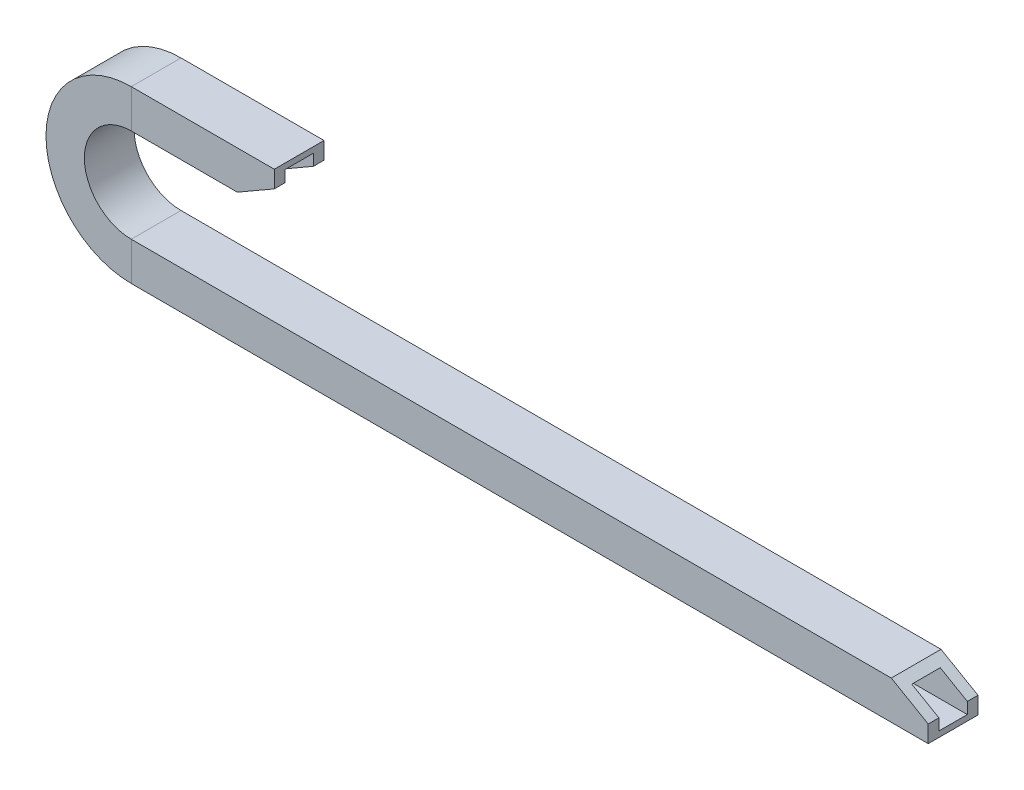
ISO-10303-21;
HEADER;
FILE_DESCRIPTION(('STEP AP214'),'2;1');
FILE_NAME('part.step','',(''),(''),'','','');
FILE_SCHEMA(('AUTOMOTIVE_DESIGN { 1 0 10303 214 1 1 1 1 }'));
ENDSEC;
DATA;
#1=APPLICATION_CONTEXT('core data for automotive mechanical design processes');
#2=APPLICATION_PROTOCOL_DEFINITION('international standard','automotive_design',2000,#1);
#3=PRODUCT_CONTEXT('',#1,'mechanical');
#4=PRODUCT('Part','Part','',(#3));
#5=PRODUCT_RELATED_PRODUCT_CATEGORY('part','',(#4));
#6=PRODUCT_DEFINITION_FORMATION('','',#4);
#7=PRODUCT_DEFINITION_CONTEXT('part definition',#1,'design');
#8=PRODUCT_DEFINITION('design','',#6,#7);
#9=PRODUCT_DEFINITION_SHAPE('','',#8);
#10=(LENGTH_UNIT() NAMED_UNIT(*) SI_UNIT(.MILLI.,.METRE.));
#11=(NAMED_UNIT(*) PLANE_ANGLE_UNIT() SI_UNIT($,.RADIAN.));
#12=(NAMED_UNIT(*) SI_UNIT($,.STERADIAN.) SOLID_ANGLE_UNIT());
#13=UNCERTAINTY_MEASURE_WITH_UNIT(LENGTH_MEASURE(1.E-05),#10,'distance_accuracy_value','');
#14=(GEOMETRIC_REPRESENTATION_CONTEXT(3) GLOBAL_UNCERTAINTY_ASSIGNED_CONTEXT((#13)) GLOBAL_UNIT_ASSIGNED_CONTEXT((#10,
#11,#12)) REPRESENTATION_CONTEXT('',''));
#15=CARTESIAN_POINT('',(0.,0.,0.));
#16=DIRECTION('',(0.,0.,1.));
#17=DIRECTION('',(1.,0.,0.));
#18=AXIS2_PLACEMENT_3D('',#15,#16,#17);
#19=CARTESIAN_POINT('',(-4.20000000035438,60.9799999998486,-34.5618189982806));
#20=DIRECTION('',(0.499722453489577,-0.866185586048601,0.));
#21=DIRECTION('',(0.866185586048601,0.499722453489577,0.));
#22=AXIS2_PLACEMENT_3D('',#19,#20,#21);
#23=PLANE('',#22);
#24=DIRECTION('',(0.,0.,1.));
#25=VECTOR('',#24,1.);
#26=CARTESIAN_POINT('',(-4.20000000035438,60.9799999998486,-34.5618189982806));
#27=LINE('',#26,#25);
#28=CARTESIAN_POINT('',(-4.20000000035438,60.9799999998486,-8.75000000000001));
#29=VERTEX_POINT('',#28);
#30=CARTESIAN_POINT('',(-4.20000000035438,60.9799999998486,-5.));
#31=VERTEX_POINT('',#30);
#32=EDGE_CURVE('E394',#29,#31,#27,.T.);
#33=ORIENTED_EDGE('',*,*,#32,.T.);
#34=DIRECTION('',(-0.866185586048601,-0.499722453489577,0.));
#35=VECTOR('',#34,1.);
#36=CARTESIAN_POINT('',(-4.20000000035438,60.9799999998486,-5.));
#37=LINE('',#36,#35);
#38=CARTESIAN_POINT('',(-13.7333333336876,55.4799999998487,-5.));
#39=VERTEX_POINT('',#38);
#40=EDGE_CURVE('E531',#31,#39,#37,.T.);
#41=ORIENTED_EDGE('',*,*,#40,.T.);
#42=DIRECTION('',(0.,0.,1.));
#43=VECTOR('',#42,1.);
#44=CARTESIAN_POINT('',(-13.7333333336876,55.4799999998487,-34.5618189982806));
#45=LINE('',#44,#43);
#46=CARTESIAN_POINT('',(-13.7333333336877,55.4799999998487,5.));
#47=VERTEX_POINT('',#46);
#48=EDGE_CURVE('E13',#39,#47,#45,.T.);
#49=ORIENTED_EDGE('',*,*,#48,.T.);
#50=DIRECTION('',(0.866185586048601,0.499722453489577,0.));
#51=VECTOR('',#50,1.);
#52=CARTESIAN_POINT('',(-4.20000000035438,60.9799999998486,5.));
#53=LINE('',#52,#51);
#54=CARTESIAN_POINT('',(-4.20000000035438,60.9799999998486,5.));
#55=VERTEX_POINT('',#54);
#56=EDGE_CURVE('E535',#47,#55,#53,.T.);
#57=ORIENTED_EDGE('',*,*,#56,.T.);
#58=CARTESIAN_POINT('',(-4.20000000035438,60.9799999998486,8.75000000000001));
#59=VERTEX_POINT('',#58);
#60=EDGE_CURVE('E400',#55,#59,#27,.T.);
#61=ORIENTED_EDGE('',*,*,#60,.T.);
#62=DIRECTION('',(0.866185586048601,0.499722453489577,0.));
#63=VECTOR('',#62,1.);
#64=CARTESIAN_POINT('',(-4.20000000035438,60.9799999998486,8.75000000000001));
#65=LINE('',#64,#63);
#66=CARTESIAN_POINT('',(-17.2000000003544,53.4799999998485,8.75000000000001));
#67=VERTEX_POINT('',#66);
#68=EDGE_CURVE('E418',#67,#59,#65,.T.);
#69=ORIENTED_EDGE('',*,*,#68,.F.);
#70=DIRECTION('',(0.,0.,1.));
#71=VECTOR('',#70,1.);
#72=CARTESIAN_POINT('',(-17.2000000003544,53.4799999998485,-34.5618189982806));
#73=LINE('',#72,#71);
#74=CARTESIAN_POINT('',(-17.2000000003544,53.4799999998485,-8.75000000000001));
#75=VERTEX_POINT('',#74);
#76=EDGE_CURVE('E404',#75,#67,#73,.T.);
#77=ORIENTED_EDGE('',*,*,#76,.F.);
#78=DIRECTION('',(0.866185586048601,0.499722453489577,0.));
#79=VECTOR('',#78,1.);
#80=CARTESIAN_POINT('',(-4.20000000035438,60.9799999998486,-8.75000000000001));
#81=LINE('',#80,#79);
#82=EDGE_CURVE('E420',#75,#29,#81,.T.);
#83=ORIENTED_EDGE('',*,*,#82,.T.);
#84=EDGE_LOOP('',(#33,#41,#49,#57,#61,#69,#77,#83));
#85=FACE_BOUND('',#84,.T.);
#86=ADVANCED_FACE('F48',(#85),#23,.T.);
#87=CARTESIAN_POINT('',(-4.20000000035438,66.9799999998486,-34.5618189982806));
#88=DIRECTION('',(1.,0.,0.));
#89=DIRECTION('',(0.,0.,-1.));
#90=AXIS2_PLACEMENT_3D('',#87,#88,#89);
#91=PLANE('',#90);
#92=DIRECTION('',(0.,0.,1.));
#93=VECTOR('',#92,1.);
#94=CARTESIAN_POINT('',(-4.20000000035438,64.9799999998486,5.));
#95=LINE('',#94,#93);
#96=CARTESIAN_POINT('',(-4.20000000035438,64.9799999998486,-5.));
#97=VERTEX_POINT('',#96);
#98=CARTESIAN_POINT('',(-4.20000000035438,64.9799999998486,5.));
#99=VERTEX_POINT('',#98);
#100=EDGE_CURVE('E246',#97,#99,#95,.T.);
#101=ORIENTED_EDGE('',*,*,#100,.F.);
#102=DIRECTION('',(0.,-1.,0.));
#103=VECTOR('',#102,1.);
#104=CARTESIAN_POINT('',(-4.20000000035438,66.9799999998486,-5.));
#105=LINE('',#104,#103);
#106=EDGE_CURVE('E58',#97,#31,#105,.T.);
#107=ORIENTED_EDGE('',*,*,#106,.T.);
#108=ORIENTED_EDGE('',*,*,#32,.F.);
#109=DIRECTION('',(0.,1.,0.));
#110=VECTOR('',#109,1.);
#111=CARTESIAN_POINT('',(-4.20000000035438,66.9799999998486,-8.75000000000001));
#112=LINE('',#111,#110);
#113=CARTESIAN_POINT('',(-4.20000000035438,66.9799999998486,-8.75000000000001));
#114=VERTEX_POINT('',#113);
#115=EDGE_CURVE('E399',#29,#114,#112,.T.);
#116=ORIENTED_EDGE('',*,*,#115,.T.);
#117=DIRECTION('',(0.,0.,1.));
#118=VECTOR('',#117,1.);
#119=CARTESIAN_POINT('',(-4.20000000035438,66.9799999998486,-34.5618189982806));
#120=LINE('',#119,#118);
#121=CARTESIAN_POINT('',(-4.20000000035438,66.9799999998486,8.75000000000001));
#122=VERTEX_POINT('',#121);
#123=EDGE_CURVE('E401',#114,#122,#120,.T.);
#124=ORIENTED_EDGE('',*,*,#123,.T.);
#125=DIRECTION('',(0.,1.,0.));
#126=VECTOR('',#125,1.);
#127=CARTESIAN_POINT('',(-4.20000000035438,66.9799999998486,8.75000000000001));
#128=LINE('',#127,#126);
#129=EDGE_CURVE('E827',#59,#122,#128,.T.);
#130=ORIENTED_EDGE('',*,*,#129,.F.);
#131=ORIENTED_EDGE('',*,*,#60,.F.);
#132=DIRECTION('',(0.,-1.,0.));
#133=VECTOR('',#132,1.);
#134=CARTESIAN_POINT('',(-4.20000000035438,64.9799999998486,5.));
#135=LINE('',#134,#133);
#136=EDGE_CURVE('E379',#99,#55,#135,.T.);
#137=ORIENTED_EDGE('',*,*,#136,.F.);
#138=EDGE_LOOP('',(#101,#107,#108,#116,#124,#130,#131,#137));
#139=FACE_BOUND('',#138,.T.);
#140=ADVANCED_FACE('F824',(#139),#91,.T.);
#141=CARTESIAN_POINT('',(225.81795525974,7.00000000020795,-34.5618189982806));
#142=DIRECTION('',(1.,0.,0.));
#143=DIRECTION('',(0.,0.,-1.));
#144=AXIS2_PLACEMENT_3D('',#141,#142,#143);
#145=PLANE('',#144);
#146=DIRECTION('',(0.,0.,1.));
#147=VECTOR('',#146,1.);
#148=CARTESIAN_POINT('',(225.81795525974,13.000000000208,-34.5618189982806));
#149=LINE('',#148,#147);
#150=CARTESIAN_POINT('',(225.81795525974,13.000000000208,-8.75000000000001));
#151=VERTEX_POINT('',#150);
#152=CARTESIAN_POINT('',(225.81795525974,13.000000000208,-5.));
#153=VERTEX_POINT('',#152);
#154=EDGE_CURVE('E239',#151,#153,#149,.T.);
#155=ORIENTED_EDGE('',*,*,#154,.T.);
#156=DIRECTION('',(0.,1.,0.));
#157=VECTOR('',#156,1.);
#158=CARTESIAN_POINT('',(225.81795525974,9.0000000002079,-5.));
#159=LINE('',#158,#157);
#160=CARTESIAN_POINT('',(225.81795525974,9.0000000002079,-5.));
#161=VERTEX_POINT('',#160);
#162=EDGE_CURVE('E215',#161,#153,#159,.T.);
#163=ORIENTED_EDGE('',*,*,#162,.F.);
#164=DIRECTION('',(0.,0.,-1.));
#165=VECTOR('',#164,1.);
#166=CARTESIAN_POINT('',(225.81795525974,9.0000000002079,5.));
#167=LINE('',#166,#165);
#168=CARTESIAN_POINT('',(225.81795525974,9.0000000002079,5.));
#169=VERTEX_POINT('',#168);
#170=EDGE_CURVE('E227',#169,#161,#167,.T.);
#171=ORIENTED_EDGE('',*,*,#170,.F.);
#172=DIRECTION('',(0.,-1.,0.));
#173=VECTOR('',#172,1.);
#174=CARTESIAN_POINT('',(225.81795525974,9.0000000002079,5.));
#175=LINE('',#174,#173);
#176=CARTESIAN_POINT('',(225.81795525974,13.000000000208,5.));
#177=VERTEX_POINT('',#176);
#178=EDGE_CURVE('E241',#177,#169,#175,.T.);
#179=ORIENTED_EDGE('',*,*,#178,.F.);
#180=CARTESIAN_POINT('',(225.81795525974,13.000000000208,8.75000000000001));
#181=VERTEX_POINT('',#180);
#182=EDGE_CURVE('E272',#177,#181,#149,.T.);
#183=ORIENTED_EDGE('',*,*,#182,.T.);
#184=DIRECTION('',(0.,1.,0.));
#185=VECTOR('',#184,1.);
#186=CARTESIAN_POINT('',(225.81795525974,7.00000000020795,8.75000000000001));
#187=LINE('',#186,#185);
#188=CARTESIAN_POINT('',(225.81795525974,7.00000000020795,8.75000000000001));
#189=VERTEX_POINT('',#188);
#190=EDGE_CURVE('E495',#189,#181,#187,.T.);
#191=ORIENTED_EDGE('',*,*,#190,.F.);
#192=DIRECTION('',(0.,0.,1.));
#193=VECTOR('',#192,1.);
#194=CARTESIAN_POINT('',(225.81795525974,7.00000000020795,-34.5618189982806));
#195=LINE('',#194,#193);
#196=CARTESIAN_POINT('',(225.81795525974,7.00000000020795,-8.75000000000001));
#197=VERTEX_POINT('',#196);
#198=EDGE_CURVE('E276',#197,#189,#195,.T.);
#199=ORIENTED_EDGE('',*,*,#198,.F.);
#200=DIRECTION('',(0.,1.,0.));
#201=VECTOR('',#200,1.);
#202=CARTESIAN_POINT('',(225.81795525974,7.00000000020795,-8.75000000000001));
#203=LINE('',#202,#201);
#204=EDGE_CURVE('E497',#197,#151,#203,.T.);
#205=ORIENTED_EDGE('',*,*,#204,.T.);
#206=EDGE_LOOP('',(#155,#163,#171,#179,#183,#191,#199,#205));
#207=FACE_BOUND('',#206,.T.);
#208=ADVANCED_FACE('F236',(#207),#145,.T.);
#209=CARTESIAN_POINT('',(225.81795525974,13.000000000208,-34.5618189982806));
#210=DIRECTION('',(0.499722453489576,0.866185586048601,0.));
#211=DIRECTION('',(-0.866185586048601,0.499722453489576,0.));
#212=AXIS2_PLACEMENT_3D('',#209,#210,#211);
#213=PLANE('',#212);
#214=DIRECTION('',(0.,0.,-1.));
#215=VECTOR('',#214,1.);
#216=CARTESIAN_POINT('',(216.284621926407,18.5000000002079,-34.5618189982806));
#217=LINE('',#216,#215);
#218=CARTESIAN_POINT('',(216.284621926407,18.5000000002079,5.));
#219=VERTEX_POINT('',#218);
#220=CARTESIAN_POINT('',(216.284621926407,18.5000000002079,-5.));
#221=VERTEX_POINT('',#220);
#222=EDGE_CURVE('E300',#219,#221,#217,.T.);
#223=ORIENTED_EDGE('',*,*,#222,.T.);
#224=DIRECTION('',(0.866185586048601,-0.499722453489576,0.));
#225=VECTOR('',#224,1.);
#226=CARTESIAN_POINT('',(225.81795525974,13.000000000208,-5.));
#227=LINE('',#226,#225);
#228=EDGE_CURVE('E481',#221,#153,#227,.T.);
#229=ORIENTED_EDGE('',*,*,#228,.T.);
#230=ORIENTED_EDGE('',*,*,#154,.F.);
#231=DIRECTION('',(-0.866185586048601,0.499722453489576,0.));
#232=VECTOR('',#231,1.);
#233=CARTESIAN_POINT('',(225.81795525974,13.000000000208,-8.75000000000001));
#234=LINE('',#233,#232);
#235=CARTESIAN_POINT('',(212.81795525974,20.5000000002079,-8.75000000000001));
#236=VERTEX_POINT('',#235);
#237=EDGE_CURVE('E271',#151,#236,#234,.T.);
#238=ORIENTED_EDGE('',*,*,#237,.T.);
#239=DIRECTION('',(0.,0.,1.));
#240=VECTOR('',#239,1.);
#241=CARTESIAN_POINT('',(212.81795525974,20.5000000002079,-34.5618189982806));
#242=LINE('',#241,#240);
#243=CARTESIAN_POINT('',(212.81795525974,20.5000000002079,8.75000000000001));
#244=VERTEX_POINT('',#243);
#245=EDGE_CURVE('E273',#236,#244,#242,.T.);
#246=ORIENTED_EDGE('',*,*,#245,.T.);
#247=DIRECTION('',(-0.866185586048601,0.499722453489576,0.));
#248=VECTOR('',#247,1.);
#249=CARTESIAN_POINT('',(225.81795525974,13.000000000208,8.75000000000001));
#250=LINE('',#249,#248);
#251=EDGE_CURVE('E537',#181,#244,#250,.T.);
#252=ORIENTED_EDGE('',*,*,#251,.F.);
#253=ORIENTED_EDGE('',*,*,#182,.F.);
#254=DIRECTION('',(-0.866185586048601,0.499722453489576,0.));
#255=VECTOR('',#254,1.);
#256=CARTESIAN_POINT('',(225.81795525974,13.000000000208,5.));
#257=LINE('',#256,#255);
#258=EDGE_CURVE('E294',#177,#219,#257,.T.);
#259=ORIENTED_EDGE('',*,*,#258,.T.);
#260=EDGE_LOOP('',(#223,#229,#230,#238,#246,#252,#253,#259));
#261=FACE_BOUND('',#260,.T.);
#262=ADVANCED_FACE('F892',(#261),#213,.T.);
#263=CARTESIAN_POINT('',(203.81795525974,20.5000000002079,8.75000000000001));
#264=DIRECTION('',(0.,1.,0.));
#265=DIRECTION('',(-1.,0.,0.));
#266=AXIS2_PLACEMENT_3D('',#263,#264,#265);
#267=PLANE('',#266);
#268=DIRECTION('',(-1.,0.,0.));
#269=VECTOR('',#268,1.);
#270=CARTESIAN_POINT('',(203.81795525974,20.5000000002079,-8.75000000000001));
#271=LINE('',#270,#269);
#272=CARTESIAN_POINT('',(-54.503416211368,20.5000000002079,-8.75000000000001));
#273=VERTEX_POINT('',#272);
#274=EDGE_CURVE('E470',#236,#273,#271,.T.);
#275=ORIENTED_EDGE('',*,*,#274,.T.);
#276=DIRECTION('',(0.,0.,-1.));
#277=VECTOR('',#276,1.);
#278=CARTESIAN_POINT('',(-54.503416211368,20.5000000002079,8.75000000000001));
#279=LINE('',#278,#277);
#280=CARTESIAN_POINT('',(-54.503416211368,20.5000000002079,8.75000000000001));
#281=VERTEX_POINT('',#280);
#282=EDGE_CURVE('E466',#281,#273,#279,.T.);
#283=ORIENTED_EDGE('',*,*,#282,.F.);
#284=DIRECTION('',(-1.,0.,0.));
#285=VECTOR('',#284,1.);
#286=CARTESIAN_POINT('',(203.81795525974,20.5000000002079,8.75000000000001));
#287=LINE('',#286,#285);
#288=EDGE_CURVE('E457',#244,#281,#287,.T.);
#289=ORIENTED_EDGE('',*,*,#288,.F.);
#290=ORIENTED_EDGE('',*,*,#245,.F.);
#291=EDGE_LOOP('',(#275,#283,#289,#290));
#292=FACE_BOUND('',#291,.T.);
#293=ADVANCED_FACE('F888',(#292),#267,.T.);
#294=CARTESIAN_POINT('',(203.81795525974,20.5000000002079,-8.75000000000001));
#295=DIRECTION('',(0.,0.,-1.));
#296=DIRECTION('',(-1.,0.,0.));
#297=AXIS2_PLACEMENT_3D('',#294,#295,#296);
#298=PLANE('',#297);
#299=DIRECTION('',(-1.,0.,0.));
#300=VECTOR('',#299,1.);
#301=CARTESIAN_POINT('',(203.81795525974,7.00000000020795,-8.75000000000001));
#302=LINE('',#301,#300);
#303=CARTESIAN_POINT('',(-54.503416211368,7.00000000020784,-8.75000000000001));
#304=VERTEX_POINT('',#303);
#305=EDGE_CURVE('E508',#197,#304,#302,.T.);
#306=ORIENTED_EDGE('',*,*,#305,.T.);
#307=DIRECTION('',(0.,-1.,0.));
#308=VECTOR('',#307,1.);
#309=CARTESIAN_POINT('',(-54.503416211368,20.5000000002079,-8.75000000000001));
#310=LINE('',#309,#308);
#311=EDGE_CURVE('E512',#273,#304,#310,.T.);
#312=ORIENTED_EDGE('',*,*,#311,.F.);
#313=ORIENTED_EDGE('',*,*,#274,.F.);
#314=ORIENTED_EDGE('',*,*,#237,.F.);
#315=ORIENTED_EDGE('',*,*,#204,.F.);
#316=EDGE_LOOP('',(#306,#312,#313,#314,#315));
#317=FACE_BOUND('',#316,.T.);
#318=ADVANCED_FACE('F891',(#317),#298,.T.);
#319=CARTESIAN_POINT('',(203.81795525974,7.00000000020795,8.75000000000001));
#320=DIRECTION('',(0.,-1.,0.));
#321=DIRECTION('',(1.,0.,0.));
#322=AXIS2_PLACEMENT_3D('',#319,#320,#321);
#323=PLANE('',#322);
#324=DIRECTION('',(-1.,0.,0.));
#325=VECTOR('',#324,1.);
#326=CARTESIAN_POINT('',(203.81795525974,7.00000000020795,8.75000000000001));
#327=LINE('',#326,#325);
#328=CARTESIAN_POINT('',(-54.503416211368,7.00000000020784,8.75000000000001));
#329=VERTEX_POINT('',#328);
#330=EDGE_CURVE('E320',#189,#329,#327,.T.);
#331=ORIENTED_EDGE('',*,*,#330,.T.);
#332=DIRECTION('',(0.,0.,1.));
#333=VECTOR('',#332,1.);
#334=CARTESIAN_POINT('',(-54.503416211368,7.00000000020784,8.75000000000001));
#335=LINE('',#334,#333);
#336=EDGE_CURVE('E350',#304,#329,#335,.T.);
#337=ORIENTED_EDGE('',*,*,#336,.F.);
#338=ORIENTED_EDGE('',*,*,#305,.F.);
#339=ORIENTED_EDGE('',*,*,#198,.T.);
#340=EDGE_LOOP('',(#331,#337,#338,#339));
#341=FACE_BOUND('',#340,.T.);
#342=ADVANCED_FACE('F842',(#341),#323,.T.);
#343=CARTESIAN_POINT('',(203.81795525974,20.5000000002079,8.75000000000001));
#344=DIRECTION('',(0.,0.,1.));
#345=DIRECTION('',(0.,-1.,0.));
#346=AXIS2_PLACEMENT_3D('',#343,#344,#345);
#347=PLANE('',#346);
#348=DIRECTION('',(0.,1.,0.));
#349=VECTOR('',#348,1.);
#350=CARTESIAN_POINT('',(-54.503416211368,20.5000000002079,8.75000000000001));
#351=LINE('',#350,#349);
#352=EDGE_CURVE('E314',#329,#281,#351,.T.);
#353=ORIENTED_EDGE('',*,*,#352,.F.);
#354=ORIENTED_EDGE('',*,*,#330,.F.);
#355=ORIENTED_EDGE('',*,*,#190,.T.);
#356=ORIENTED_EDGE('',*,*,#251,.T.);
#357=ORIENTED_EDGE('',*,*,#288,.T.);
#358=EDGE_LOOP('',(#353,#354,#355,#356,#357));
#359=FACE_BOUND('',#358,.T.);
#360=ADVANCED_FACE('F898',(#359),#347,.T.);
#361=CARTESIAN_POINT('',(-54.503416211368,36.9900000000283,0.));
#362=DIRECTION('',(0.,0.,-1.));
#363=DIRECTION('',(-1.,0.,0.));
#364=AXIS2_PLACEMENT_3D('',#361,#362,#363);
#365=CYLINDRICAL_SURFACE('',#364,16.4899999998203);
#366=CARTESIAN_POINT('',(-54.503416211368,36.9900000000283,-8.75000000000001));
#367=DIRECTION('',(0.,0.,-1.));
#368=DIRECTION('',(0.,-1.,0.));
#369=AXIS2_PLACEMENT_3D('',#366,#367,#368);
#370=CIRCLE('',#369,16.4899999998203);
#371=CARTESIAN_POINT('',(-54.503416211368,53.4799999998484,-8.75000000000001));
#372=VERTEX_POINT('',#371);
#373=EDGE_CURVE('E456',#273,#372,#370,.T.);
#374=ORIENTED_EDGE('',*,*,#373,.T.);
#375=DIRECTION('',(0.,0.,-1.));
#376=VECTOR('',#375,1.);
#377=CARTESIAN_POINT('',(-54.503416211368,53.4799999998487,8.75000000000001));
#378=LINE('',#377,#376);
#379=CARTESIAN_POINT('',(-54.503416211368,53.4799999998484,8.75000000000001));
#380=VERTEX_POINT('',#379);
#381=EDGE_CURVE('E451',#380,#372,#378,.T.);
#382=ORIENTED_EDGE('',*,*,#381,.F.);
#383=CARTESIAN_POINT('',(-54.503416211368,36.9900000000283,8.75000000000001));
#384=DIRECTION('',(0.,0.,-1.));
#385=DIRECTION('',(0.,-1.,0.));
#386=AXIS2_PLACEMENT_3D('',#383,#384,#385);
#387=CIRCLE('',#386,16.4899999998203);
#388=EDGE_CURVE('E319',#281,#380,#387,.T.);
#389=ORIENTED_EDGE('',*,*,#388,.F.);
#390=ORIENTED_EDGE('',*,*,#282,.T.);
#391=EDGE_LOOP('',(#374,#382,#389,#390));
#392=FACE_BOUND('',#391,.T.);
#393=ADVANCED_FACE('F894',(#392),#365,.F.);
#394=CARTESIAN_POINT('',(-54.503416211368,20.500000000208,-8.75000000000001));
#395=DIRECTION('',(0.,0.,-1.));
#396=DIRECTION('',(-1.,0.,0.));
#397=AXIS2_PLACEMENT_3D('',#394,#395,#396);
#398=PLANE('',#397);
#399=CARTESIAN_POINT('',(-54.503416211368,36.9900000000283,-8.75000000000001));
#400=DIRECTION('',(0.,0.,-1.));
#401=DIRECTION('',(0.,-1.,0.));
#402=AXIS2_PLACEMENT_3D('',#399,#400,#401);
#403=CIRCLE('',#402,29.9899999998203);
#404=CARTESIAN_POINT('',(-54.503416211368,66.9799999998485,-8.75000000000001));
#405=VERTEX_POINT('',#404);
#406=EDGE_CURVE('E347',#304,#405,#403,.T.);
#407=ORIENTED_EDGE('',*,*,#406,.T.);
#408=DIRECTION('',(0.,1.,0.));
#409=VECTOR('',#408,1.);
#410=CARTESIAN_POINT('',(-54.503416211368,53.4799999998487,-8.75000000000001));
#411=LINE('',#410,#409);
#412=EDGE_CURVE('E514',#372,#405,#411,.T.);
#413=ORIENTED_EDGE('',*,*,#412,.F.);
#414=ORIENTED_EDGE('',*,*,#373,.F.);
#415=ORIENTED_EDGE('',*,*,#311,.T.);
#416=EDGE_LOOP('',(#407,#413,#414,#415));
#417=FACE_BOUND('',#416,.T.);
#418=ADVANCED_FACE('F897',(#417),#398,.T.);
#419=CARTESIAN_POINT('',(-54.503416211368,36.9900000000283,0.));
#420=DIRECTION('',(0.,0.,-1.));
#421=DIRECTION('',(-1.,0.,0.));
#422=AXIS2_PLACEMENT_3D('',#419,#420,#421);
#423=CYLINDRICAL_SURFACE('',#422,29.9899999998203);
#424=CARTESIAN_POINT('',(-54.503416211368,36.9900000000283,8.75000000000001));
#425=DIRECTION('',(0.,0.,-1.));
#426=DIRECTION('',(0.,-1.,0.));
#427=AXIS2_PLACEMENT_3D('',#424,#425,#426);
#428=CIRCLE('',#427,29.9899999998203);
#429=CARTESIAN_POINT('',(-54.503416211368,66.9799999998485,8.75000000000001));
#430=VERTEX_POINT('',#429);
#431=EDGE_CURVE('E326',#329,#430,#428,.T.);
#432=ORIENTED_EDGE('',*,*,#431,.T.);
#433=DIRECTION('',(0.,0.,1.));
#434=VECTOR('',#433,1.);
#435=CARTESIAN_POINT('',(-54.503416211368,66.9799999998486,8.75000000000001));
#436=LINE('',#435,#434);
#437=EDGE_CURVE('E359',#405,#430,#436,.T.);
#438=ORIENTED_EDGE('',*,*,#437,.F.);
#439=ORIENTED_EDGE('',*,*,#406,.F.);
#440=ORIENTED_EDGE('',*,*,#336,.T.);
#441=EDGE_LOOP('',(#432,#438,#439,#440));
#442=FACE_BOUND('',#441,.T.);
#443=ADVANCED_FACE('F911',(#442),#423,.T.);
#444=CARTESIAN_POINT('',(-54.503416211368,20.500000000208,8.75000000000001));
#445=DIRECTION('',(0.,0.,1.));
#446=DIRECTION('',(1.,0.,0.));
#447=AXIS2_PLACEMENT_3D('',#444,#445,#446);
#448=PLANE('',#447);
#449=DIRECTION('',(0.,-1.,0.));
#450=VECTOR('',#449,1.);
#451=CARTESIAN_POINT('',(-54.503416211368,53.4799999998487,8.75000000000001));
#452=LINE('',#451,#450);
#453=EDGE_CURVE('E302',#430,#380,#452,.T.);
#454=ORIENTED_EDGE('',*,*,#453,.F.);
#455=ORIENTED_EDGE('',*,*,#431,.F.);
#456=ORIENTED_EDGE('',*,*,#352,.T.);
#457=ORIENTED_EDGE('',*,*,#388,.T.);
#458=EDGE_LOOP('',(#454,#455,#456,#457));
#459=FACE_BOUND('',#458,.T.);
#460=ADVANCED_FACE('F904',(#459),#448,.T.);
#461=CARTESIAN_POINT('',(-54.503416211368,53.4799999998485,8.75000000000001));
#462=DIRECTION('',(0.,-1.,0.));
#463=DIRECTION('',(0.,0.,-1.));
#464=AXIS2_PLACEMENT_3D('',#461,#462,#463);
#465=PLANE('',#464);
#466=DIRECTION('',(1.,0.,0.));
#467=VECTOR('',#466,1.);
#468=CARTESIAN_POINT('',(-54.503416211368,53.4799999998485,-8.75000000000001));
#469=LINE('',#468,#467);
#470=EDGE_CURVE('E346',#372,#75,#469,.T.);
#471=ORIENTED_EDGE('',*,*,#470,.T.);
#472=ORIENTED_EDGE('',*,*,#76,.T.);
#473=DIRECTION('',(1.,0.,0.));
#474=VECTOR('',#473,1.);
#475=CARTESIAN_POINT('',(-54.503416211368,53.4799999998485,8.75000000000001));
#476=LINE('',#475,#474);
#477=EDGE_CURVE('E439',#380,#67,#476,.T.);
#478=ORIENTED_EDGE('',*,*,#477,.F.);
#479=ORIENTED_EDGE('',*,*,#381,.T.);
#480=EDGE_LOOP('',(#471,#472,#478,#479));
#481=FACE_BOUND('',#480,.T.);
#482=ADVANCED_FACE('F900',(#481),#465,.T.);
#483=CARTESIAN_POINT('',(-54.503416211368,53.4799999998485,-8.75000000000001));
#484=DIRECTION('',(0.,0.,-1.));
#485=DIRECTION('',(-1.,0.,0.));
#486=AXIS2_PLACEMENT_3D('',#483,#484,#485);
#487=PLANE('',#486);
#488=DIRECTION('',(1.,0.,0.));
#489=VECTOR('',#488,1.);
#490=CARTESIAN_POINT('',(-54.503416211368,66.9799999998486,-8.75000000000001));
#491=LINE('',#490,#489);
#492=EDGE_CURVE('E325',#405,#114,#491,.T.);
#493=ORIENTED_EDGE('',*,*,#492,.T.);
#494=ORIENTED_EDGE('',*,*,#115,.F.);
#495=ORIENTED_EDGE('',*,*,#82,.F.);
#496=ORIENTED_EDGE('',*,*,#470,.F.);
#497=ORIENTED_EDGE('',*,*,#412,.T.);
#498=EDGE_LOOP('',(#493,#494,#495,#496,#497));
#499=FACE_BOUND('',#498,.T.);
#500=ADVANCED_FACE('F903',(#499),#487,.T.);
#501=CARTESIAN_POINT('',(-54.503416211368,66.9799999998486,8.75000000000001));
#502=DIRECTION('',(0.,1.,0.));
#503=DIRECTION('',(0.,0.,1.));
#504=AXIS2_PLACEMENT_3D('',#501,#502,#503);
#505=PLANE('',#504);
#506=DIRECTION('',(1.,0.,0.));
#507=VECTOR('',#506,1.);
#508=CARTESIAN_POINT('',(-54.503416211368,66.9799999998486,8.75000000000001));
#509=LINE('',#508,#507);
#510=EDGE_CURVE('E301',#430,#122,#509,.T.);
#511=ORIENTED_EDGE('',*,*,#510,.T.);
#512=ORIENTED_EDGE('',*,*,#123,.F.);
#513=ORIENTED_EDGE('',*,*,#492,.F.);
#514=ORIENTED_EDGE('',*,*,#437,.T.);
#515=EDGE_LOOP('',(#511,#512,#513,#514));
#516=FACE_BOUND('',#515,.T.);
#517=ADVANCED_FACE('F915',(#516),#505,.T.);
#518=CARTESIAN_POINT('',(-54.503416211368,53.4799999998485,8.75000000000001));
#519=DIRECTION('',(0.,0.,1.));
#520=DIRECTION('',(0.,-1.,0.));
#521=AXIS2_PLACEMENT_3D('',#518,#519,#520);
#522=PLANE('',#521);
#523=ORIENTED_EDGE('',*,*,#477,.T.);
#524=ORIENTED_EDGE('',*,*,#68,.T.);
#525=ORIENTED_EDGE('',*,*,#129,.T.);
#526=ORIENTED_EDGE('',*,*,#510,.F.);
#527=ORIENTED_EDGE('',*,*,#453,.T.);
#528=EDGE_LOOP('',(#523,#524,#525,#526,#527));
#529=FACE_BOUND('',#528,.T.);
#530=ADVANCED_FACE('F50',(#529),#522,.T.);
#531=CARTESIAN_POINT('',(-26.2000000003544,64.9799999998486,-5.));
#532=DIRECTION('',(0.,0.,1.));
#533=DIRECTION('',(0.,-1.,0.));
#534=AXIS2_PLACEMENT_3D('',#531,#532,#533);
#535=PLANE('',#534);
#536=ORIENTED_EDGE('',*,*,#106,.F.);
#537=DIRECTION('',(1.,0.,0.));
#538=VECTOR('',#537,1.);
#539=CARTESIAN_POINT('',(-26.2000000003544,64.9799999998486,-5.));
#540=LINE('',#539,#538);
#541=CARTESIAN_POINT('',(-26.2000000003544,64.9799999998486,-5.));
#542=VERTEX_POINT('',#541);
#543=EDGE_CURVE('E65',#542,#97,#540,.T.);
#544=ORIENTED_EDGE('',*,*,#543,.F.);
#545=DIRECTION('',(0.,-1.,0.));
#546=VECTOR('',#545,1.);
#547=CARTESIAN_POINT('',(-26.2000000003544,64.9799999998486,-5.));
#548=LINE('',#547,#546);
#549=CARTESIAN_POINT('',(-26.2000000003544,55.4799999998487,-5.));
#550=VERTEX_POINT('',#549);
#551=EDGE_CURVE('E667',#542,#550,#548,.T.);
#552=ORIENTED_EDGE('',*,*,#551,.T.);
#553=DIRECTION('',(1.,0.,0.));
#554=VECTOR('',#553,1.);
#555=CARTESIAN_POINT('',(-26.2000000003544,55.4799999998487,-5.));
#556=LINE('',#555,#554);
#557=EDGE_CURVE('E570',#550,#39,#556,.T.);
#558=ORIENTED_EDGE('',*,*,#557,.T.);
#559=ORIENTED_EDGE('',*,*,#40,.F.);
#560=EDGE_LOOP('',(#536,#544,#552,#558,#559));
#561=FACE_BOUND('',#560,.T.);
#562=ADVANCED_FACE('F859',(#561),#535,.T.);
#563=CARTESIAN_POINT('',(-26.2000000003544,55.4799999998487,5.));
#564=DIRECTION('',(0.,1.,0.));
#565=DIRECTION('',(-1.,0.,0.));
#566=AXIS2_PLACEMENT_3D('',#563,#564,#565);
#567=PLANE('',#566);
#568=ORIENTED_EDGE('',*,*,#557,.F.);
#569=DIRECTION('',(0.,0.,1.));
#570=VECTOR('',#569,1.);
#571=CARTESIAN_POINT('',(-26.2000000003544,55.4799999998487,5.));
#572=LINE('',#571,#570);
#573=CARTESIAN_POINT('',(-26.2000000003544,55.4799999998487,5.));
#574=VERTEX_POINT('',#573);
#575=EDGE_CURVE('E546',#550,#574,#572,.T.);
#576=ORIENTED_EDGE('',*,*,#575,.T.);
#577=DIRECTION('',(1.,0.,0.));
#578=VECTOR('',#577,1.);
#579=CARTESIAN_POINT('',(-26.2000000003544,55.4799999998487,5.));
#580=LINE('',#579,#578);
#581=EDGE_CURVE('E566',#574,#47,#580,.T.);
#582=ORIENTED_EDGE('',*,*,#581,.T.);
#583=ORIENTED_EDGE('',*,*,#48,.F.);
#584=EDGE_LOOP('',(#568,#576,#582,#583));
#585=FACE_BOUND('',#584,.T.);
#586=ADVANCED_FACE('F856',(#585),#567,.T.);
#587=CARTESIAN_POINT('',(-26.2000000003544,64.9799999998486,5.));
#588=DIRECTION('',(0.,0.,-1.));
#589=DIRECTION('',(-1.,0.,0.));
#590=AXIS2_PLACEMENT_3D('',#587,#588,#589);
#591=PLANE('',#590);
#592=ORIENTED_EDGE('',*,*,#581,.F.);
#593=DIRECTION('',(0.,1.,0.));
#594=VECTOR('',#593,1.);
#595=CARTESIAN_POINT('',(-26.2000000003544,64.9799999998486,5.));
#596=LINE('',#595,#594);
#597=CARTESIAN_POINT('',(-26.2000000003544,64.9799999998486,5.));
#598=VERTEX_POINT('',#597);
#599=EDGE_CURVE('E705',#574,#598,#596,.T.);
#600=ORIENTED_EDGE('',*,*,#599,.T.);
#601=DIRECTION('',(1.,0.,0.));
#602=VECTOR('',#601,1.);
#603=CARTESIAN_POINT('',(-26.2000000003544,64.9799999998486,5.));
#604=LINE('',#603,#602);
#605=EDGE_CURVE('E223',#598,#99,#604,.T.);
#606=ORIENTED_EDGE('',*,*,#605,.T.);
#607=ORIENTED_EDGE('',*,*,#136,.T.);
#608=ORIENTED_EDGE('',*,*,#56,.F.);
#609=EDGE_LOOP('',(#592,#600,#606,#607,#608));
#610=FACE_BOUND('',#609,.T.);
#611=ADVANCED_FACE('F955',(#610),#591,.T.);
#612=CARTESIAN_POINT('',(-26.2000000003544,64.9799999998486,5.));
#613=DIRECTION('',(0.,-1.,0.));
#614=DIRECTION('',(1.,0.,0.));
#615=AXIS2_PLACEMENT_3D('',#612,#613,#614);
#616=PLANE('',#615);
#617=ORIENTED_EDGE('',*,*,#100,.T.);
#618=ORIENTED_EDGE('',*,*,#605,.F.);
#619=DIRECTION('',(0.,0.,-1.));
#620=VECTOR('',#619,1.);
#621=CARTESIAN_POINT('',(-26.2000000003544,64.9799999998486,5.));
#622=LINE('',#621,#620);
#623=EDGE_CURVE('E714',#598,#542,#622,.T.);
#624=ORIENTED_EDGE('',*,*,#623,.T.);
#625=ORIENTED_EDGE('',*,*,#543,.T.);
#626=EDGE_LOOP('',(#617,#618,#624,#625));
#627=FACE_BOUND('',#626,.T.);
#628=ADVANCED_FACE('F865',(#627),#616,.T.);
#629=CARTESIAN_POINT('',(226.81795525974,9.0000000002079,-5.));
#630=DIRECTION('',(0.,0.,1.));
#631=DIRECTION('',(0.,-1.,0.));
#632=AXIS2_PLACEMENT_3D('',#629,#630,#631);
#633=PLANE('',#632);
#634=DIRECTION('',(-1.,0.,0.));
#635=VECTOR('',#634,1.);
#636=CARTESIAN_POINT('',(226.81795525974,18.5000000002079,-5.));
#637=LINE('',#636,#635);
#638=CARTESIAN_POINT('',(203.81795525974,18.5000000002079,-5.));
#639=VERTEX_POINT('',#638);
#640=EDGE_CURVE('E630',#221,#639,#637,.T.);
#641=ORIENTED_EDGE('',*,*,#640,.T.);
#642=DIRECTION('',(0.,1.,0.));
#643=VECTOR('',#642,1.);
#644=CARTESIAN_POINT('',(203.81795525974,9.00000000020784,-5.));
#645=LINE('',#644,#643);
#646=CARTESIAN_POINT('',(203.81795525974,9.0000000002079,-5.));
#647=VERTEX_POINT('',#646);
#648=EDGE_CURVE('E218',#647,#639,#645,.T.);
#649=ORIENTED_EDGE('',*,*,#648,.F.);
#650=DIRECTION('',(-1.,0.,0.));
#651=VECTOR('',#650,1.);
#652=CARTESIAN_POINT('',(226.81795525974,9.0000000002079,-5.));
#653=LINE('',#652,#651);
#654=EDGE_CURVE('E211',#161,#647,#653,.T.);
#655=ORIENTED_EDGE('',*,*,#654,.F.);
#656=ORIENTED_EDGE('',*,*,#162,.T.);
#657=ORIENTED_EDGE('',*,*,#228,.F.);
#658=EDGE_LOOP('',(#641,#649,#655,#656,#657));
#659=FACE_BOUND('',#658,.T.);
#660=ADVANCED_FACE('F213',(#659),#633,.T.);
#661=CARTESIAN_POINT('',(226.81795525974,18.5000000002079,5.));
#662=DIRECTION('',(0.,-1.,0.));
#663=DIRECTION('',(0.,0.,-1.));
#664=AXIS2_PLACEMENT_3D('',#661,#662,#663);
#665=PLANE('',#664);
#666=DIRECTION('',(-1.,0.,0.));
#667=VECTOR('',#666,1.);
#668=CARTESIAN_POINT('',(226.81795525974,18.5000000002079,5.));
#669=LINE('',#668,#667);
#670=CARTESIAN_POINT('',(203.81795525974,18.5000000002079,5.));
#671=VERTEX_POINT('',#670);
#672=EDGE_CURVE('E73',#219,#671,#669,.T.);
#673=ORIENTED_EDGE('',*,*,#672,.T.);
#674=DIRECTION('',(0.,0.,1.));
#675=VECTOR('',#674,1.);
#676=CARTESIAN_POINT('',(203.81795525974,18.5000000002079,5.));
#677=LINE('',#676,#675);
#678=EDGE_CURVE('E642',#639,#671,#677,.T.);
#679=ORIENTED_EDGE('',*,*,#678,.F.);
#680=ORIENTED_EDGE('',*,*,#640,.F.);
#681=ORIENTED_EDGE('',*,*,#222,.F.);
#682=EDGE_LOOP('',(#673,#679,#680,#681));
#683=FACE_BOUND('',#682,.T.);
#684=ADVANCED_FACE('F1050',(#683),#665,.T.);
#685=CARTESIAN_POINT('',(226.81795525974,9.0000000002079,5.));
#686=DIRECTION('',(0.,0.,-1.));
#687=DIRECTION('',(-1.,0.,0.));
#688=AXIS2_PLACEMENT_3D('',#685,#686,#687);
#689=PLANE('',#688);
#690=ORIENTED_EDGE('',*,*,#178,.T.);
#691=DIRECTION('',(-1.,0.,0.));
#692=VECTOR('',#691,1.);
#693=CARTESIAN_POINT('',(226.81795525974,9.0000000002079,5.));
#694=LINE('',#693,#692);
#695=CARTESIAN_POINT('',(203.81795525974,9.0000000002079,5.));
#696=VERTEX_POINT('',#695);
#697=EDGE_CURVE('E229',#169,#696,#694,.T.);
#698=ORIENTED_EDGE('',*,*,#697,.T.);
#699=DIRECTION('',(0.,-1.,0.));
#700=VECTOR('',#699,1.);
#701=CARTESIAN_POINT('',(203.81795525974,9.00000000020784,5.));
#702=LINE('',#701,#700);
#703=EDGE_CURVE('E641',#671,#696,#702,.T.);
#704=ORIENTED_EDGE('',*,*,#703,.F.);
#705=ORIENTED_EDGE('',*,*,#672,.F.);
#706=ORIENTED_EDGE('',*,*,#258,.F.);
#707=EDGE_LOOP('',(#690,#698,#704,#705,#706));
#708=FACE_BOUND('',#707,.T.);
#709=ADVANCED_FACE('F790',(#708),#689,.T.);
#710=CARTESIAN_POINT('',(226.81795525974,9.0000000002079,5.));
#711=DIRECTION('',(0.,1.,0.));
#712=DIRECTION('',(0.,0.,1.));
#713=AXIS2_PLACEMENT_3D('',#710,#711,#712);
#714=PLANE('',#713);
#715=ORIENTED_EDGE('',*,*,#170,.T.);
#716=ORIENTED_EDGE('',*,*,#654,.T.);
#717=DIRECTION('',(0.,0.,-1.));
#718=VECTOR('',#717,1.);
#719=CARTESIAN_POINT('',(203.81795525974,9.00000000020784,5.));
#720=LINE('',#719,#718);
#721=EDGE_CURVE('E609',#696,#647,#720,.T.);
#722=ORIENTED_EDGE('',*,*,#721,.F.);
#723=ORIENTED_EDGE('',*,*,#697,.F.);
#724=EDGE_LOOP('',(#715,#716,#722,#723));
#725=FACE_BOUND('',#724,.T.);
#726=ADVANCED_FACE('F228',(#725),#714,.T.);
#727=CARTESIAN_POINT('',(203.81795525974,9.00000000020779,-5.));
#728=DIRECTION('',(0.,0.,1.));
#729=DIRECTION('',(0.,-1.,0.));
#730=AXIS2_PLACEMENT_3D('',#727,#728,#729);
#731=PLANE('',#730);
#732=DIRECTION('',(-1.,0.,0.));
#733=VECTOR('',#732,1.);
#734=CARTESIAN_POINT('',(203.81795525974,18.5000000002078,-5.));
#735=LINE('',#734,#733);
#736=CARTESIAN_POINT('',(-54.503416211368,18.5000000002077,-5.));
#737=VERTEX_POINT('',#736);
#738=EDGE_CURVE('E767',#639,#737,#735,.T.);
#739=ORIENTED_EDGE('',*,*,#738,.T.);
#740=DIRECTION('',(0.,1.,0.));
#741=VECTOR('',#740,1.);
#742=CARTESIAN_POINT('',(-54.503416211368,9.00000000020773,-5.));
#743=LINE('',#742,#741);
#744=CARTESIAN_POINT('',(-54.503416211368,9.00000000020773,-5.));
#745=VERTEX_POINT('',#744);
#746=EDGE_CURVE('E763',#745,#737,#743,.T.);
#747=ORIENTED_EDGE('',*,*,#746,.F.);
#748=DIRECTION('',(-1.,0.,0.));
#749=VECTOR('',#748,1.);
#750=CARTESIAN_POINT('',(203.81795525974,9.00000000020779,-5.));
#751=LINE('',#750,#749);
#752=EDGE_CURVE('E614',#647,#745,#751,.T.);
#753=ORIENTED_EDGE('',*,*,#752,.F.);
#754=ORIENTED_EDGE('',*,*,#648,.T.);
#755=EDGE_LOOP('',(#739,#747,#753,#754));
#756=FACE_BOUND('',#755,.T.);
#757=ADVANCED_FACE('F803',(#756),#731,.T.);
#758=CARTESIAN_POINT('',(203.81795525974,18.5000000002078,5.));
#759=DIRECTION('',(0.,-1.,0.));
#760=DIRECTION('',(1.,0.,0.));
#761=AXIS2_PLACEMENT_3D('',#758,#759,#760);
#762=PLANE('',#761);
#763=DIRECTION('',(-1.,0.,0.));
#764=VECTOR('',#763,1.);
#765=CARTESIAN_POINT('',(203.81795525974,18.5000000002078,5.));
#766=LINE('',#765,#764);
#767=CARTESIAN_POINT('',(-54.503416211368,18.5000000002077,5.));
#768=VERTEX_POINT('',#767);
#769=EDGE_CURVE('E749',#671,#768,#766,.T.);
#770=ORIENTED_EDGE('',*,*,#769,.T.);
#771=DIRECTION('',(0.,0.,1.));
#772=VECTOR('',#771,1.);
#773=CARTESIAN_POINT('',(-54.503416211368,18.5000000002077,5.));
#774=LINE('',#773,#772);
#775=EDGE_CURVE('E754',#737,#768,#774,.T.);
#776=ORIENTED_EDGE('',*,*,#775,.F.);
#777=ORIENTED_EDGE('',*,*,#738,.F.);
#778=ORIENTED_EDGE('',*,*,#678,.T.);
#779=EDGE_LOOP('',(#770,#776,#777,#778));
#780=FACE_BOUND('',#779,.T.);
#781=ADVANCED_FACE('F782',(#780),#762,.T.);
#782=CARTESIAN_POINT('',(203.81795525974,9.00000000020779,5.));
#783=DIRECTION('',(0.,0.,-1.));
#784=DIRECTION('',(-1.,0.,0.));
#785=AXIS2_PLACEMENT_3D('',#782,#783,#784);
#786=PLANE('',#785);
#787=DIRECTION('',(-1.,0.,0.));
#788=VECTOR('',#787,1.);
#789=CARTESIAN_POINT('',(203.81795525974,9.00000000020779,5.));
#790=LINE('',#789,#788);
#791=CARTESIAN_POINT('',(-54.503416211368,9.00000000020773,5.));
#792=VERTEX_POINT('',#791);
#793=EDGE_CURVE('E587',#696,#792,#790,.T.);
#794=ORIENTED_EDGE('',*,*,#793,.T.);
#795=DIRECTION('',(0.,-1.,0.));
#796=VECTOR('',#795,1.);
#797=CARTESIAN_POINT('',(-54.503416211368,9.00000000020773,5.));
#798=LINE('',#797,#796);
#799=EDGE_CURVE('E595',#768,#792,#798,.T.);
#800=ORIENTED_EDGE('',*,*,#799,.F.);
#801=ORIENTED_EDGE('',*,*,#769,.F.);
#802=ORIENTED_EDGE('',*,*,#703,.T.);
#803=EDGE_LOOP('',(#794,#800,#801,#802));
#804=FACE_BOUND('',#803,.T.);
#805=ADVANCED_FACE('F788',(#804),#786,.T.);
#806=CARTESIAN_POINT('',(203.81795525974,9.00000000020779,5.));
#807=DIRECTION('',(0.,1.,0.));
#808=DIRECTION('',(-1.,0.,0.));
#809=AXIS2_PLACEMENT_3D('',#806,#807,#808);
#810=PLANE('',#809);
#811=DIRECTION('',(0.,0.,-1.));
#812=VECTOR('',#811,1.);
#813=CARTESIAN_POINT('',(-54.503416211368,9.00000000020773,5.));
#814=LINE('',#813,#812);
#815=EDGE_CURVE('E594',#792,#745,#814,.T.);
#816=ORIENTED_EDGE('',*,*,#815,.F.);
#817=ORIENTED_EDGE('',*,*,#793,.F.);
#818=ORIENTED_EDGE('',*,*,#721,.T.);
#819=ORIENTED_EDGE('',*,*,#752,.T.);
#820=EDGE_LOOP('',(#816,#817,#818,#819));
#821=FACE_BOUND('',#820,.T.);
#822=ADVANCED_FACE('F794',(#821),#810,.T.);
#823=CARTESIAN_POINT('',(-54.503416211368,9.00000000020784,-5.));
#824=DIRECTION('',(0.,0.,1.));
#825=DIRECTION('',(1.,0.,0.));
#826=AXIS2_PLACEMENT_3D('',#823,#824,#825);
#827=PLANE('',#826);
#828=CARTESIAN_POINT('',(-54.503416211368,36.9900000000283,-5.));
#829=DIRECTION('',(0.,0.,-1.));
#830=DIRECTION('',(0.,-1.,0.));
#831=AXIS2_PLACEMENT_3D('',#828,#829,#830);
#832=CIRCLE('',#831,18.4899999998204);
#833=CARTESIAN_POINT('',(-54.503416211368,55.4799999998485,-5.));
#834=VERTEX_POINT('',#833);
#835=EDGE_CURVE('E664',#737,#834,#832,.T.);
#836=ORIENTED_EDGE('',*,*,#835,.T.);
#837=DIRECTION('',(0.,-1.,0.));
#838=VECTOR('',#837,1.);
#839=CARTESIAN_POINT('',(-54.503416211368,64.9799999998486,-5.));
#840=LINE('',#839,#838);
#841=CARTESIAN_POINT('',(-54.503416211368,64.9799999998486,-5.));
#842=VERTEX_POINT('',#841);
#843=EDGE_CURVE('E663',#842,#834,#840,.T.);
#844=ORIENTED_EDGE('',*,*,#843,.F.);
#845=CARTESIAN_POINT('',(-54.503416211368,36.9900000000283,-5.));
#846=DIRECTION('',(0.,0.,-1.));
#847=DIRECTION('',(0.,-1.,0.));
#848=AXIS2_PLACEMENT_3D('',#845,#846,#847);
#849=CIRCLE('',#848,27.9899999998204);
#850=EDGE_CURVE('E593',#745,#842,#849,.T.);
#851=ORIENTED_EDGE('',*,*,#850,.F.);
#852=ORIENTED_EDGE('',*,*,#746,.T.);
#853=EDGE_LOOP('',(#836,#844,#851,#852));
#854=FACE_BOUND('',#853,.T.);
#855=ADVANCED_FACE('F1099',(#854),#827,.T.);
#856=CARTESIAN_POINT('',(-54.503416211368,36.9900000000283,0.));
#857=DIRECTION('',(0.,0.,-1.));
#858=DIRECTION('',(-1.,0.,0.));
#859=AXIS2_PLACEMENT_3D('',#856,#857,#858);
#860=CYLINDRICAL_SURFACE('',#859,18.4899999998204);
#861=CARTESIAN_POINT('',(-54.503416211368,36.9900000000283,5.));
#862=DIRECTION('',(0.,0.,-1.));
#863=DIRECTION('',(0.,-1.,0.));
#864=AXIS2_PLACEMENT_3D('',#861,#862,#863);
#865=CIRCLE('',#864,18.4899999998204);
#866=CARTESIAN_POINT('',(-54.503416211368,55.4799999998485,5.));
#867=VERTEX_POINT('',#866);
#868=EDGE_CURVE('E554',#768,#867,#865,.T.);
#869=ORIENTED_EDGE('',*,*,#868,.T.);
#870=DIRECTION('',(0.,0.,1.));
#871=VECTOR('',#870,1.);
#872=CARTESIAN_POINT('',(-54.503416211368,55.4799999998487,5.));
#873=LINE('',#872,#871);
#874=EDGE_CURVE('E735',#834,#867,#873,.T.);
#875=ORIENTED_EDGE('',*,*,#874,.F.);
#876=ORIENTED_EDGE('',*,*,#835,.F.);
#877=ORIENTED_EDGE('',*,*,#775,.T.);
#878=EDGE_LOOP('',(#869,#875,#876,#877));
#879=FACE_BOUND('',#878,.T.);
#880=ADVANCED_FACE('F780',(#879),#860,.T.);
#881=CARTESIAN_POINT('',(-54.503416211368,9.00000000020784,5.));
#882=DIRECTION('',(0.,0.,-1.));
#883=DIRECTION('',(-1.,0.,0.));
#884=AXIS2_PLACEMENT_3D('',#881,#882,#883);
#885=PLANE('',#884);
#886=CARTESIAN_POINT('',(-54.503416211368,36.9900000000283,5.));
#887=DIRECTION('',(0.,0.,-1.));
#888=DIRECTION('',(0.,-1.,0.));
#889=AXIS2_PLACEMENT_3D('',#886,#887,#888);
#890=CIRCLE('',#889,27.9899999998204);
#891=CARTESIAN_POINT('',(-54.503416211368,64.9799999998486,5.));
#892=VERTEX_POINT('',#891);
#893=EDGE_CURVE('E691',#792,#892,#890,.T.);
#894=ORIENTED_EDGE('',*,*,#893,.T.);
#895=DIRECTION('',(0.,1.,0.));
#896=VECTOR('',#895,1.);
#897=CARTESIAN_POINT('',(-54.503416211368,64.9799999998486,5.));
#898=LINE('',#897,#896);
#899=EDGE_CURVE('E597',#867,#892,#898,.T.);
#900=ORIENTED_EDGE('',*,*,#899,.F.);
#901=ORIENTED_EDGE('',*,*,#868,.F.);
#902=ORIENTED_EDGE('',*,*,#799,.T.);
#903=EDGE_LOOP('',(#894,#900,#901,#902));
#904=FACE_BOUND('',#903,.T.);
#905=ADVANCED_FACE('F798',(#904),#885,.T.);
#906=CARTESIAN_POINT('',(-54.503416211368,36.9900000000283,0.));
#907=DIRECTION('',(0.,0.,-1.));
#908=DIRECTION('',(-1.,0.,0.));
#909=AXIS2_PLACEMENT_3D('',#906,#907,#908);
#910=CYLINDRICAL_SURFACE('',#909,27.9899999998204);
#911=DIRECTION('',(0.,0.,-1.));
#912=VECTOR('',#911,1.);
#913=CARTESIAN_POINT('',(-54.503416211368,64.9799999998486,5.));
#914=LINE('',#913,#912);
#915=EDGE_CURVE('E704',#892,#842,#914,.T.);
#916=ORIENTED_EDGE('',*,*,#915,.F.);
#917=ORIENTED_EDGE('',*,*,#893,.F.);
#918=ORIENTED_EDGE('',*,*,#815,.T.);
#919=ORIENTED_EDGE('',*,*,#850,.T.);
#920=EDGE_LOOP('',(#916,#917,#918,#919));
#921=FACE_BOUND('',#920,.T.);
#922=ADVANCED_FACE('F802',(#921),#910,.F.);
#923=CARTESIAN_POINT('',(-54.503416211368,64.9799999998486,-5.));
#924=DIRECTION('',(0.,0.,1.));
#925=DIRECTION('',(0.,-1.,0.));
#926=AXIS2_PLACEMENT_3D('',#923,#924,#925);
#927=PLANE('',#926);
#928=DIRECTION('',(1.,0.,0.));
#929=VECTOR('',#928,1.);
#930=CARTESIAN_POINT('',(-54.503416211368,55.4799999998487,-5.));
#931=LINE('',#930,#929);
#932=EDGE_CURVE('E553',#834,#550,#931,.T.);
#933=ORIENTED_EDGE('',*,*,#932,.T.);
#934=ORIENTED_EDGE('',*,*,#551,.F.);
#935=DIRECTION('',(1.,0.,0.));
#936=VECTOR('',#935,1.);
#937=CARTESIAN_POINT('',(-54.503416211368,64.9799999998486,-5.));
#938=LINE('',#937,#936);
#939=EDGE_CURVE('E686',#842,#542,#938,.T.);
#940=ORIENTED_EDGE('',*,*,#939,.F.);
#941=ORIENTED_EDGE('',*,*,#843,.T.);
#942=EDGE_LOOP('',(#933,#934,#940,#941));
#943=FACE_BOUND('',#942,.T.);
#944=ADVANCED_FACE('F867',(#943),#927,.T.);
#945=CARTESIAN_POINT('',(-54.503416211368,55.4799999998487,5.));
#946=DIRECTION('',(0.,1.,0.));
#947=DIRECTION('',(-1.,0.,0.));
#948=AXIS2_PLACEMENT_3D('',#945,#946,#947);
#949=PLANE('',#948);
#950=DIRECTION('',(1.,0.,0.));
#951=VECTOR('',#950,1.);
#952=CARTESIAN_POINT('',(-54.503416211368,55.4799999998487,5.));
#953=LINE('',#952,#951);
#954=EDGE_CURVE('E552',#867,#574,#953,.T.);
#955=ORIENTED_EDGE('',*,*,#954,.T.);
#956=ORIENTED_EDGE('',*,*,#575,.F.);
#957=ORIENTED_EDGE('',*,*,#932,.F.);
#958=ORIENTED_EDGE('',*,*,#874,.T.);
#959=EDGE_LOOP('',(#955,#956,#957,#958));
#960=FACE_BOUND('',#959,.T.);
#961=ADVANCED_FACE('F854',(#960),#949,.T.);
#962=CARTESIAN_POINT('',(-54.503416211368,64.9799999998486,5.));
#963=DIRECTION('',(0.,0.,-1.));
#964=DIRECTION('',(-1.,0.,0.));
#965=AXIS2_PLACEMENT_3D('',#962,#963,#964);
#966=PLANE('',#965);
#967=DIRECTION('',(1.,0.,0.));
#968=VECTOR('',#967,1.);
#969=CARTESIAN_POINT('',(-54.503416211368,64.9799999998486,5.));
#970=LINE('',#969,#968);
#971=EDGE_CURVE('E233',#892,#598,#970,.T.);
#972=ORIENTED_EDGE('',*,*,#971,.T.);
#973=ORIENTED_EDGE('',*,*,#599,.F.);
#974=ORIENTED_EDGE('',*,*,#954,.F.);
#975=ORIENTED_EDGE('',*,*,#899,.T.);
#976=EDGE_LOOP('',(#972,#973,#974,#975));
#977=FACE_BOUND('',#976,.T.);
#978=ADVANCED_FACE('F870',(#977),#966,.T.);
#979=CARTESIAN_POINT('',(-54.503416211368,64.9799999998486,5.));
#980=DIRECTION('',(0.,-1.,0.));
#981=DIRECTION('',(1.,0.,0.));
#982=AXIS2_PLACEMENT_3D('',#979,#980,#981);
#983=PLANE('',#982);
#984=ORIENTED_EDGE('',*,*,#623,.F.);
#985=ORIENTED_EDGE('',*,*,#971,.F.);
#986=ORIENTED_EDGE('',*,*,#915,.T.);
#987=ORIENTED_EDGE('',*,*,#939,.T.);
#988=EDGE_LOOP('',(#984,#985,#986,#987));
#989=FACE_BOUND('',#988,.T.);
#990=ADVANCED_FACE('F868',(#989),#983,.T.);
#991=CLOSED_SHELL('',(#86,#140,#208,#262,#293,#318,#342,#360,#393,#418,#443,#460,#482,#500,#517,
#530,#562,#586,#611,#628,#660,#684,#709,#726,#757,#781,#805,#822,#855,#880,#905,#922,#944,#961,
#978,#990));
#992=MANIFOLD_SOLID_BREP('B2',#991);
#993=ADVANCED_BREP_SHAPE_REPRESENTATION('',(#18,#992),#14);
#994=SHAPE_DEFINITION_REPRESENTATION(#9,#993);
ENDSEC;
END-ISO-10303-21;
